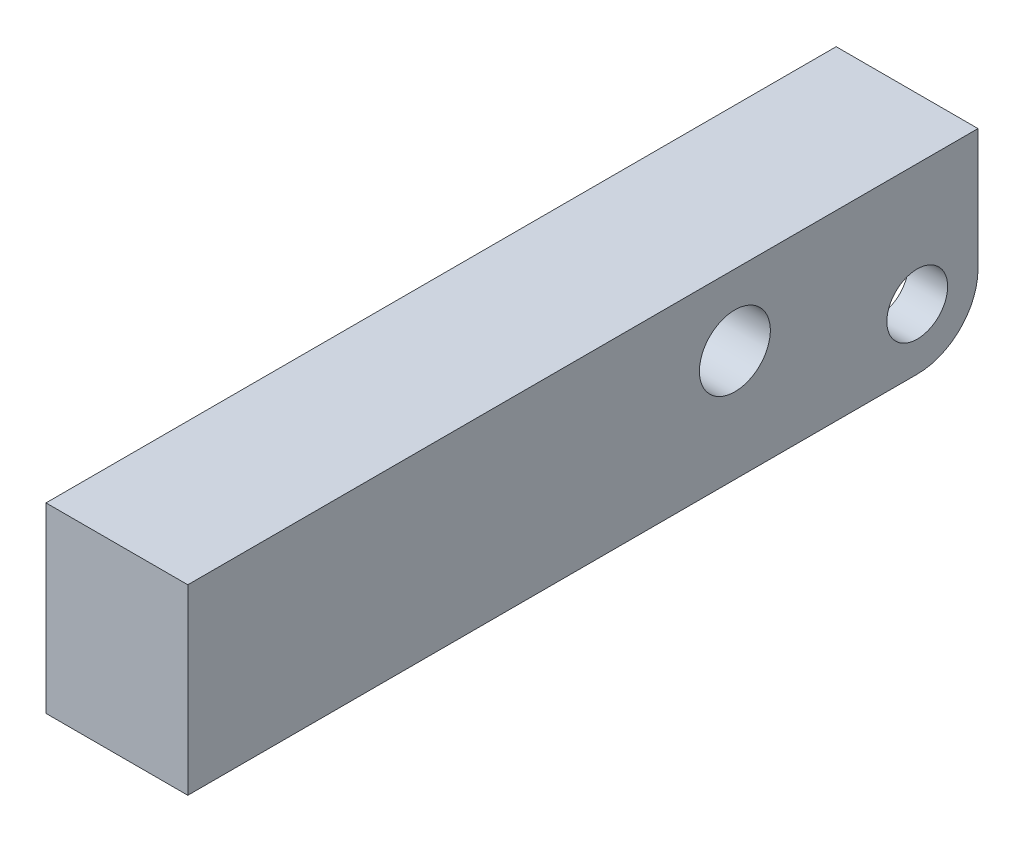
ISO-10303-21;
HEADER;
FILE_DESCRIPTION(('STEP AP214'),'2;1');
FILE_NAME('part.step','',(''),(''),'','','');
FILE_SCHEMA(('AUTOMOTIVE_DESIGN { 1 0 10303 214 1 1 1 1 }'));
ENDSEC;
DATA;
#1=APPLICATION_CONTEXT('core data for automotive mechanical design processes');
#2=APPLICATION_PROTOCOL_DEFINITION('international standard','automotive_design',2000,#1);
#3=PRODUCT_CONTEXT('',#1,'mechanical');
#4=PRODUCT('Part','Part','',(#3));
#5=PRODUCT_RELATED_PRODUCT_CATEGORY('part','',(#4));
#6=PRODUCT_DEFINITION_FORMATION('','',#4);
#7=PRODUCT_DEFINITION_CONTEXT('part definition',#1,'design');
#8=PRODUCT_DEFINITION('design','',#6,#7);
#9=PRODUCT_DEFINITION_SHAPE('','',#8);
#10=(LENGTH_UNIT() NAMED_UNIT(*) SI_UNIT(.MILLI.,.METRE.));
#11=(NAMED_UNIT(*) PLANE_ANGLE_UNIT() SI_UNIT($,.RADIAN.));
#12=(NAMED_UNIT(*) SI_UNIT($,.STERADIAN.) SOLID_ANGLE_UNIT());
#13=UNCERTAINTY_MEASURE_WITH_UNIT(LENGTH_MEASURE(1.E-05),#10,'distance_accuracy_value','');
#14=(GEOMETRIC_REPRESENTATION_CONTEXT(3) GLOBAL_UNCERTAINTY_ASSIGNED_CONTEXT((#13)) GLOBAL_UNIT_ASSIGNED_CONTEXT((#10,
#11,#12)) REPRESENTATION_CONTEXT('',''));
#15=CARTESIAN_POINT('',(0.,0.,0.));
#16=DIRECTION('',(0.,0.,1.));
#17=DIRECTION('',(1.,0.,0.));
#18=AXIS2_PLACEMENT_3D('',#15,#16,#17);
#19=CARTESIAN_POINT('',(-50.,5.99999999999999,6.));
#20=DIRECTION('',(1.,0.,0.));
#21=DIRECTION('',(0.,0.,-1.));
#22=AXIS2_PLACEMENT_3D('',#19,#20,#21);
#23=CYLINDRICAL_SURFACE('',#22,3.);
#24=CARTESIAN_POINT('',(-3.15,5.99999999999999,6.));
#25=DIRECTION('',(-1.,0.,0.));
#26=DIRECTION('',(0.,0.,1.));
#27=AXIS2_PLACEMENT_3D('',#24,#25,#26);
#28=CIRCLE('',#27,3.);
#29=CARTESIAN_POINT('',(-3.15,5.99999999999999,9.));
#30=VERTEX_POINT('',#29);
#31=EDGE_CURVE('E199',#30,#30,#28,.F.);
#32=ORIENTED_EDGE('',*,*,#31,.T.);
#33=EDGE_LOOP('',(#32));
#34=FACE_BOUND('',#33,.T.);
#35=CARTESIAN_POINT('',(-7.,5.99999999999999,6.));
#36=DIRECTION('',(-1.,0.,0.));
#37=DIRECTION('',(0.,0.,1.));
#38=AXIS2_PLACEMENT_3D('',#35,#36,#37);
#39=CIRCLE('',#38,3.);
#40=CARTESIAN_POINT('',(-7.,5.99999999999999,9.));
#41=VERTEX_POINT('',#40);
#42=EDGE_CURVE('E162',#41,#41,#39,.T.);
#43=ORIENTED_EDGE('',*,*,#42,.T.);
#44=EDGE_LOOP('',(#43));
#45=FACE_BOUND('',#44,.T.);
#46=ADVANCED_FACE('F33',(#34,#45),#23,.F.);
#47=CARTESIAN_POINT('',(-7.,18.,0.));
#48=DIRECTION('',(0.,0.,-1.));
#49=DIRECTION('',(0.,1.,0.));
#50=AXIS2_PLACEMENT_3D('',#47,#48,#49);
#51=PLANE('',#50);
#52=DIRECTION('',(0.,1.,0.));
#53=VECTOR('',#52,1.);
#54=CARTESIAN_POINT('',(7.,18.,0.));
#55=LINE('',#54,#53);
#56=CARTESIAN_POINT('',(7.,6.,0.));
#57=VERTEX_POINT('',#56);
#58=CARTESIAN_POINT('',(7.,18.,0.));
#59=VERTEX_POINT('',#58);
#60=EDGE_CURVE('E165',#57,#59,#55,.T.);
#61=ORIENTED_EDGE('',*,*,#60,.F.);
#62=DIRECTION('',(1.,0.,0.));
#63=VECTOR('',#62,1.);
#64=CARTESIAN_POINT('',(-7.,6.,0.));
#65=LINE('',#64,#63);
#66=CARTESIAN_POINT('',(3.15,6.,0.));
#67=VERTEX_POINT('',#66);
#68=EDGE_CURVE('E212',#57,#67,#65,.F.);
#69=ORIENTED_EDGE('',*,*,#68,.T.);
#70=DIRECTION('',(0.,-1.,0.));
#71=VECTOR('',#70,1.);
#72=CARTESIAN_POINT('',(3.15,13.2,0.));
#73=LINE('',#72,#71);
#74=CARTESIAN_POINT('',(3.15,13.2,0.));
#75=VERTEX_POINT('',#74);
#76=EDGE_CURVE('E132',#75,#67,#73,.T.);
#77=ORIENTED_EDGE('',*,*,#76,.F.);
#78=DIRECTION('',(1.,0.,0.));
#79=VECTOR('',#78,1.);
#80=CARTESIAN_POINT('',(-3.15,13.2,0.));
#81=LINE('',#80,#79);
#82=CARTESIAN_POINT('',(-3.15,13.2,0.));
#83=VERTEX_POINT('',#82);
#84=EDGE_CURVE('E139',#83,#75,#81,.T.);
#85=ORIENTED_EDGE('',*,*,#84,.F.);
#86=DIRECTION('',(0.,-1.,0.));
#87=VECTOR('',#86,1.);
#88=CARTESIAN_POINT('',(-3.15,13.2,0.));
#89=LINE('',#88,#87);
#90=CARTESIAN_POINT('',(-3.15,6.,0.));
#91=VERTEX_POINT('',#90);
#92=EDGE_CURVE('E122',#83,#91,#89,.T.);
#93=ORIENTED_EDGE('',*,*,#92,.T.);
#94=DIRECTION('',(1.,0.,0.));
#95=VECTOR('',#94,1.);
#96=CARTESIAN_POINT('',(-7.,6.,0.));
#97=LINE('',#96,#95);
#98=CARTESIAN_POINT('',(-7.,6.,0.));
#99=VERTEX_POINT('',#98);
#100=EDGE_CURVE('E210',#91,#99,#97,.F.);
#101=ORIENTED_EDGE('',*,*,#100,.T.);
#102=DIRECTION('',(0.,1.,0.));
#103=VECTOR('',#102,1.);
#104=CARTESIAN_POINT('',(-7.,18.,0.));
#105=LINE('',#104,#103);
#106=CARTESIAN_POINT('',(-7.,18.,0.));
#107=VERTEX_POINT('',#106);
#108=EDGE_CURVE('E176',#99,#107,#105,.T.);
#109=ORIENTED_EDGE('',*,*,#108,.T.);
#110=DIRECTION('',(1.,0.,0.));
#111=VECTOR('',#110,1.);
#112=CARTESIAN_POINT('',(-7.,18.,0.));
#113=LINE('',#112,#111);
#114=EDGE_CURVE('E187',#107,#59,#113,.T.);
#115=ORIENTED_EDGE('',*,*,#114,.T.);
#116=EDGE_LOOP('',(#61,#69,#77,#85,#93,#101,#109,#115));
#117=FACE_BOUND('',#116,.T.);
#118=ADVANCED_FACE('F144',(#117),#51,.T.);
#119=CARTESIAN_POINT('',(-7.,0.,0.));
#120=DIRECTION('',(0.,-1.,0.));
#121=DIRECTION('',(0.,0.,-1.));
#122=AXIS2_PLACEMENT_3D('',#119,#120,#121);
#123=PLANE('',#122);
#124=CARTESIAN_POINT('',(0.,0.,13.2));
#125=DIRECTION('',(0.,-1.,0.));
#126=DIRECTION('',(0.,0.,-1.));
#127=AXIS2_PLACEMENT_3D('',#124,#125,#126);
#128=CIRCLE('',#127,3.89999999999999);
#129=CARTESIAN_POINT('',(-3.89999999999999,0.,13.2));
#130=VERTEX_POINT('',#129);
#131=CARTESIAN_POINT('',(3.89999999999999,0.,13.2));
#132=VERTEX_POINT('',#131);
#133=EDGE_CURVE('E225',#130,#132,#128,.F.);
#134=ORIENTED_EDGE('',*,*,#133,.T.);
#135=DIRECTION('',(0.,0.,-1.));
#136=VECTOR('',#135,1.);
#137=CARTESIAN_POINT('',(3.89999999999999,0.,6.));
#138=LINE('',#137,#136);
#139=CARTESIAN_POINT('',(3.89999999999999,0.,6.));
#140=VERTEX_POINT('',#139);
#141=EDGE_CURVE('E227',#132,#140,#138,.T.);
#142=ORIENTED_EDGE('',*,*,#141,.T.);
#143=DIRECTION('',(1.,0.,0.));
#144=VECTOR('',#143,1.);
#145=CARTESIAN_POINT('',(-7.,0.,6.));
#146=LINE('',#145,#144);
#147=CARTESIAN_POINT('',(7.,0.,6.));
#148=VERTEX_POINT('',#147);
#149=EDGE_CURVE('E206',#140,#148,#146,.T.);
#150=ORIENTED_EDGE('',*,*,#149,.T.);
#151=DIRECTION('',(0.,0.,-1.));
#152=VECTOR('',#151,1.);
#153=CARTESIAN_POINT('',(7.,0.,0.));
#154=LINE('',#153,#152);
#155=CARTESIAN_POINT('',(7.,0.,78.));
#156=VERTEX_POINT('',#155);
#157=EDGE_CURVE('E173',#156,#148,#154,.T.);
#158=ORIENTED_EDGE('',*,*,#157,.F.);
#159=DIRECTION('',(1.,0.,0.));
#160=VECTOR('',#159,1.);
#161=CARTESIAN_POINT('',(-7.,0.,78.));
#162=LINE('',#161,#160);
#163=CARTESIAN_POINT('',(-7.,0.,78.));
#164=VERTEX_POINT('',#163);
#165=EDGE_CURVE('E188',#164,#156,#162,.T.);
#166=ORIENTED_EDGE('',*,*,#165,.F.);
#167=DIRECTION('',(0.,0.,-1.));
#168=VECTOR('',#167,1.);
#169=CARTESIAN_POINT('',(-7.,0.,0.));
#170=LINE('',#169,#168);
#171=CARTESIAN_POINT('',(-7.,0.,6.));
#172=VERTEX_POINT('',#171);
#173=EDGE_CURVE('E184',#164,#172,#170,.T.);
#174=ORIENTED_EDGE('',*,*,#173,.T.);
#175=DIRECTION('',(1.,0.,0.));
#176=VECTOR('',#175,1.);
#177=CARTESIAN_POINT('',(-7.,0.,6.));
#178=LINE('',#177,#176);
#179=CARTESIAN_POINT('',(-3.89999999999999,0.,6.));
#180=VERTEX_POINT('',#179);
#181=EDGE_CURVE('E190',#172,#180,#178,.T.);
#182=ORIENTED_EDGE('',*,*,#181,.T.);
#183=DIRECTION('',(0.,0.,1.));
#184=VECTOR('',#183,1.);
#185=CARTESIAN_POINT('',(-3.89999999999999,0.,13.2));
#186=LINE('',#185,#184);
#187=EDGE_CURVE('E223',#180,#130,#186,.T.);
#188=ORIENTED_EDGE('',*,*,#187,.T.);
#189=EDGE_LOOP('',(#134,#142,#150,#158,#166,#174,#182,#188));
#190=FACE_BOUND('',#189,.T.);
#191=ADVANCED_FACE('F250',(#190),#123,.T.);
#192=CARTESIAN_POINT('',(-7.,0.,78.));
#193=DIRECTION('',(0.,0.,1.));
#194=DIRECTION('',(1.,0.,0.));
#195=AXIS2_PLACEMENT_3D('',#192,#193,#194);
#196=PLANE('',#195);
#197=ORIENTED_EDGE('',*,*,#165,.T.);
#198=DIRECTION('',(0.,-1.,0.));
#199=VECTOR('',#198,1.);
#200=CARTESIAN_POINT('',(7.,0.,78.));
#201=LINE('',#200,#199);
#202=CARTESIAN_POINT('',(7.,18.,78.));
#203=VERTEX_POINT('',#202);
#204=EDGE_CURVE('E170',#203,#156,#201,.T.);
#205=ORIENTED_EDGE('',*,*,#204,.F.);
#206=DIRECTION('',(1.,0.,0.));
#207=VECTOR('',#206,1.);
#208=CARTESIAN_POINT('',(-7.,18.,78.));
#209=LINE('',#208,#207);
#210=CARTESIAN_POINT('',(-7.,18.,78.));
#211=VERTEX_POINT('',#210);
#212=EDGE_CURVE('E191',#211,#203,#209,.T.);
#213=ORIENTED_EDGE('',*,*,#212,.F.);
#214=DIRECTION('',(0.,-1.,0.));
#215=VECTOR('',#214,1.);
#216=CARTESIAN_POINT('',(-7.,0.,78.));
#217=LINE('',#216,#215);
#218=EDGE_CURVE('E181',#211,#164,#217,.T.);
#219=ORIENTED_EDGE('',*,*,#218,.T.);
#220=EDGE_LOOP('',(#197,#205,#213,#219));
#221=FACE_BOUND('',#220,.T.);
#222=ADVANCED_FACE('F266',(#221),#196,.T.);
#223=CARTESIAN_POINT('',(-7.,18.,78.));
#224=DIRECTION('',(0.,1.,0.));
#225=DIRECTION('',(0.,0.,1.));
#226=AXIS2_PLACEMENT_3D('',#223,#224,#225);
#227=PLANE('',#226);
#228=ORIENTED_EDGE('',*,*,#212,.T.);
#229=DIRECTION('',(0.,0.,1.));
#230=VECTOR('',#229,1.);
#231=CARTESIAN_POINT('',(7.,18.,78.));
#232=LINE('',#231,#230);
#233=EDGE_CURVE('E167',#59,#203,#232,.T.);
#234=ORIENTED_EDGE('',*,*,#233,.F.);
#235=ORIENTED_EDGE('',*,*,#114,.F.);
#236=DIRECTION('',(0.,0.,1.));
#237=VECTOR('',#236,1.);
#238=CARTESIAN_POINT('',(-7.,18.,78.));
#239=LINE('',#238,#237);
#240=EDGE_CURVE('E178',#107,#211,#239,.T.);
#241=ORIENTED_EDGE('',*,*,#240,.T.);
#242=EDGE_LOOP('',(#228,#234,#235,#241));
#243=FACE_BOUND('',#242,.T.);
#244=ADVANCED_FACE('F261',(#243),#227,.T.);
#245=CARTESIAN_POINT('',(-7.,0.,0.));
#246=DIRECTION('',(-1.,0.,0.));
#247=DIRECTION('',(0.,0.,1.));
#248=AXIS2_PLACEMENT_3D('',#245,#246,#247);
#249=PLANE('',#248);
#250=CARTESIAN_POINT('',(-7.,11.,24.));
#251=DIRECTION('',(-1.,0.,0.));
#252=DIRECTION('',(0.,0.,1.));
#253=AXIS2_PLACEMENT_3D('',#250,#251,#252);
#254=CIRCLE('',#253,3.5);
#255=CARTESIAN_POINT('',(-7.,11.,27.5));
#256=VERTEX_POINT('',#255);
#257=EDGE_CURVE('E157',#256,#256,#254,.T.);
#258=ORIENTED_EDGE('',*,*,#257,.F.);
#259=EDGE_LOOP('',(#258));
#260=FACE_BOUND('',#259,.T.);
#261=ORIENTED_EDGE('',*,*,#42,.F.);
#262=EDGE_LOOP('',(#261));
#263=FACE_BOUND('',#262,.T.);
#264=ORIENTED_EDGE('',*,*,#108,.F.);
#265=CARTESIAN_POINT('',(-7.,6.,6.));
#266=DIRECTION('',(-1.,0.,0.));
#267=DIRECTION('',(0.,0.,1.));
#268=AXIS2_PLACEMENT_3D('',#265,#266,#267);
#269=CIRCLE('',#268,6.);
#270=EDGE_CURVE('E218',#99,#172,#269,.T.);
#271=ORIENTED_EDGE('',*,*,#270,.T.);
#272=ORIENTED_EDGE('',*,*,#173,.F.);
#273=ORIENTED_EDGE('',*,*,#218,.F.);
#274=ORIENTED_EDGE('',*,*,#240,.F.);
#275=EDGE_LOOP('',(#264,#271,#272,#273,#274));
#276=FACE_BOUND('',#275,.T.);
#277=ADVANCED_FACE('F256',(#260,#263,#276),#249,.T.);
#278=CARTESIAN_POINT('',(7.,0.,0.));
#279=DIRECTION('',(-1.,0.,0.));
#280=DIRECTION('',(0.,0.,1.));
#281=AXIS2_PLACEMENT_3D('',#278,#279,#280);
#282=PLANE('',#281);
#283=CARTESIAN_POINT('',(7.,11.,24.));
#284=DIRECTION('',(-1.,0.,0.));
#285=DIRECTION('',(0.,0.,1.));
#286=AXIS2_PLACEMENT_3D('',#283,#284,#285);
#287=CIRCLE('',#286,3.5);
#288=CARTESIAN_POINT('',(7.,11.,27.5));
#289=VERTEX_POINT('',#288);
#290=EDGE_CURVE('E161',#289,#289,#287,.T.);
#291=ORIENTED_EDGE('',*,*,#290,.T.);
#292=EDGE_LOOP('',(#291));
#293=FACE_BOUND('',#292,.T.);
#294=CARTESIAN_POINT('',(7.,5.99999999999999,6.));
#295=DIRECTION('',(-1.,0.,0.));
#296=DIRECTION('',(0.,0.,1.));
#297=AXIS2_PLACEMENT_3D('',#294,#295,#296);
#298=CIRCLE('',#297,3.);
#299=CARTESIAN_POINT('',(7.,5.99999999999999,9.));
#300=VERTEX_POINT('',#299);
#301=EDGE_CURVE('E160',#300,#300,#298,.T.);
#302=ORIENTED_EDGE('',*,*,#301,.T.);
#303=EDGE_LOOP('',(#302));
#304=FACE_BOUND('',#303,.T.);
#305=ORIENTED_EDGE('',*,*,#157,.T.);
#306=CARTESIAN_POINT('',(7.,6.,6.));
#307=DIRECTION('',(-1.,0.,0.));
#308=DIRECTION('',(0.,0.,1.));
#309=AXIS2_PLACEMENT_3D('',#306,#307,#308);
#310=CIRCLE('',#309,6.);
#311=EDGE_CURVE('E208',#148,#57,#310,.F.);
#312=ORIENTED_EDGE('',*,*,#311,.T.);
#313=ORIENTED_EDGE('',*,*,#60,.T.);
#314=ORIENTED_EDGE('',*,*,#233,.T.);
#315=ORIENTED_EDGE('',*,*,#204,.T.);
#316=EDGE_LOOP('',(#305,#312,#313,#314,#315));
#317=FACE_BOUND('',#316,.T.);
#318=ADVANCED_FACE('F264',(#293,#304,#317),#282,.F.);
#319=CARTESIAN_POINT('',(3.15,5.99999999999999,6.));
#320=DIRECTION('',(1.,0.,0.));
#321=DIRECTION('',(0.,0.,-1.));
#322=AXIS2_PLACEMENT_3D('',#319,#320,#321);
#323=CIRCLE('',#322,3.);
#324=CARTESIAN_POINT('',(3.15,5.99999999999999,3.));
#325=VERTEX_POINT('',#324);
#326=EDGE_CURVE('E153',#325,#325,#323,.F.);
#327=ORIENTED_EDGE('',*,*,#326,.T.);
#328=EDGE_LOOP('',(#327));
#329=FACE_BOUND('',#328,.T.);
#330=ORIENTED_EDGE('',*,*,#301,.F.);
#331=EDGE_LOOP('',(#330));
#332=FACE_BOUND('',#331,.T.);
#333=ADVANCED_FACE('F278',(#329,#332),#23,.F.);
#334=CARTESIAN_POINT('',(-50.,11.,24.));
#335=DIRECTION('',(1.,0.,0.));
#336=DIRECTION('',(0.,0.,-1.));
#337=AXIS2_PLACEMENT_3D('',#334,#335,#336);
#338=CYLINDRICAL_SURFACE('',#337,3.5);
#339=ORIENTED_EDGE('',*,*,#257,.T.);
#340=EDGE_LOOP('',(#339));
#341=FACE_BOUND('',#340,.T.);
#342=ORIENTED_EDGE('',*,*,#290,.F.);
#343=EDGE_LOOP('',(#342));
#344=FACE_BOUND('',#343,.T.);
#345=ADVANCED_FACE('F287',(#341,#344),#338,.F.);
#346=CARTESIAN_POINT('',(-3.15,13.2,13.2));
#347=DIRECTION('',(-1.,0.,0.));
#348=DIRECTION('',(0.,0.,1.));
#349=AXIS2_PLACEMENT_3D('',#346,#347,#348);
#350=PLANE('',#349);
#351=DIRECTION('',(0.,-1.,0.));
#352=VECTOR('',#351,1.);
#353=CARTESIAN_POINT('',(-3.15,13.2,13.2));
#354=LINE('',#353,#352);
#355=CARTESIAN_POINT('',(-3.15,13.2,13.2));
#356=VERTEX_POINT('',#355);
#357=CARTESIAN_POINT('',(-3.15,0.749999999999999,13.2));
#358=VERTEX_POINT('',#357);
#359=EDGE_CURVE('E151',#356,#358,#354,.T.);
#360=ORIENTED_EDGE('',*,*,#359,.T.);
#361=DIRECTION('',(0.,0.,-1.));
#362=VECTOR('',#361,1.);
#363=CARTESIAN_POINT('',(-3.15,0.75,6.));
#364=LINE('',#363,#362);
#365=CARTESIAN_POINT('',(-3.15,0.750000000000001,3.09526249034443));
#366=VERTEX_POINT('',#365);
#367=EDGE_CURVE('E42',#358,#366,#364,.T.);
#368=ORIENTED_EDGE('',*,*,#367,.T.);
#369=CARTESIAN_POINT('',(-3.15,6.,6.));
#370=DIRECTION('',(-1.,0.,0.));
#371=DIRECTION('',(0.,0.,1.));
#372=AXIS2_PLACEMENT_3D('',#369,#370,#371);
#373=CIRCLE('',#372,6.);
#374=EDGE_CURVE('E128',#366,#91,#373,.F.);
#375=ORIENTED_EDGE('',*,*,#374,.T.);
#376=ORIENTED_EDGE('',*,*,#92,.F.);
#377=DIRECTION('',(0.,0.,-1.));
#378=VECTOR('',#377,1.);
#379=CARTESIAN_POINT('',(-3.15,13.2,13.2));
#380=LINE('',#379,#378);
#381=EDGE_CURVE('E126',#356,#83,#380,.T.);
#382=ORIENTED_EDGE('',*,*,#381,.F.);
#383=EDGE_LOOP('',(#360,#368,#375,#376,#382));
#384=FACE_BOUND('',#383,.T.);
#385=ORIENTED_EDGE('',*,*,#31,.F.);
#386=EDGE_LOOP('',(#385));
#387=FACE_BOUND('',#386,.T.);
#388=ADVANCED_FACE('F124',(#384,#387),#350,.F.);
#389=CARTESIAN_POINT('',(3.15,13.2,13.2));
#390=DIRECTION('',(1.,0.,0.));
#391=DIRECTION('',(0.,0.,-1.));
#392=AXIS2_PLACEMENT_3D('',#389,#390,#391);
#393=PLANE('',#392);
#394=CARTESIAN_POINT('',(3.15,6.,6.));
#395=DIRECTION('',(1.,0.,0.));
#396=DIRECTION('',(0.,0.,-1.));
#397=AXIS2_PLACEMENT_3D('',#394,#395,#396);
#398=CIRCLE('',#397,6.);
#399=CARTESIAN_POINT('',(3.15,0.750000000000001,3.09526249034444));
#400=VERTEX_POINT('',#399);
#401=EDGE_CURVE('E214',#67,#400,#398,.F.);
#402=ORIENTED_EDGE('',*,*,#401,.T.);
#403=DIRECTION('',(0.,0.,1.));
#404=VECTOR('',#403,1.);
#405=CARTESIAN_POINT('',(3.15,0.749999999999999,13.2));
#406=LINE('',#405,#404);
#407=CARTESIAN_POINT('',(3.15,0.749999999999999,13.2));
#408=VERTEX_POINT('',#407);
#409=EDGE_CURVE('E220',#400,#408,#406,.T.);
#410=ORIENTED_EDGE('',*,*,#409,.T.);
#411=DIRECTION('',(0.,-1.,0.));
#412=VECTOR('',#411,1.);
#413=CARTESIAN_POINT('',(3.15,13.2,13.2));
#414=LINE('',#413,#412);
#415=CARTESIAN_POINT('',(3.15,13.2,13.2));
#416=VERTEX_POINT('',#415);
#417=EDGE_CURVE('E154',#416,#408,#414,.T.);
#418=ORIENTED_EDGE('',*,*,#417,.F.);
#419=DIRECTION('',(0.,0.,1.));
#420=VECTOR('',#419,1.);
#421=CARTESIAN_POINT('',(3.15,13.2,13.2));
#422=LINE('',#421,#420);
#423=EDGE_CURVE('E146',#75,#416,#422,.T.);
#424=ORIENTED_EDGE('',*,*,#423,.F.);
#425=ORIENTED_EDGE('',*,*,#76,.T.);
#426=EDGE_LOOP('',(#402,#410,#418,#424,#425));
#427=FACE_BOUND('',#426,.T.);
#428=ORIENTED_EDGE('',*,*,#326,.F.);
#429=EDGE_LOOP('',(#428));
#430=FACE_BOUND('',#429,.T.);
#431=ADVANCED_FACE('F300',(#427,#430),#393,.F.);
#432=CARTESIAN_POINT('',(0.,13.2,13.2));
#433=DIRECTION('',(0.,-1.,0.));
#434=DIRECTION('',(0.,0.,-1.));
#435=AXIS2_PLACEMENT_3D('',#432,#433,#434);
#436=CYLINDRICAL_SURFACE('',#435,3.15);
#437=ORIENTED_EDGE('',*,*,#417,.T.);
#438=CARTESIAN_POINT('',(0.,0.749999999999999,13.2));
#439=DIRECTION('',(0.,-1.,0.));
#440=DIRECTION('',(0.,0.,-1.));
#441=AXIS2_PLACEMENT_3D('',#438,#439,#440);
#442=CIRCLE('',#441,3.15);
#443=EDGE_CURVE('E57',#408,#358,#442,.T.);
#444=ORIENTED_EDGE('',*,*,#443,.T.);
#445=ORIENTED_EDGE('',*,*,#359,.F.);
#446=CARTESIAN_POINT('',(0.,13.2,13.2));
#447=DIRECTION('',(0.,-1.,0.));
#448=DIRECTION('',(0.,0.,-1.));
#449=AXIS2_PLACEMENT_3D('',#446,#447,#448);
#450=CIRCLE('',#449,3.15);
#451=EDGE_CURVE('E133',#416,#356,#450,.T.);
#452=ORIENTED_EDGE('',*,*,#451,.F.);
#453=EDGE_LOOP('',(#437,#444,#445,#452));
#454=FACE_BOUND('',#453,.T.);
#455=ADVANCED_FACE('F302',(#454),#436,.F.);
#456=CARTESIAN_POINT('',(0.,13.2,13.2));
#457=DIRECTION('',(0.,-1.,0.));
#458=DIRECTION('',(0.,0.,-1.));
#459=AXIS2_PLACEMENT_3D('',#456,#457,#458);
#460=PLANE('',#459);
#461=ORIENTED_EDGE('',*,*,#381,.T.);
#462=ORIENTED_EDGE('',*,*,#84,.T.);
#463=ORIENTED_EDGE('',*,*,#423,.T.);
#464=ORIENTED_EDGE('',*,*,#451,.T.);
#465=EDGE_LOOP('',(#461,#462,#463,#464));
#466=FACE_BOUND('',#465,.T.);
#467=ADVANCED_FACE('F137',(#466),#460,.T.);
#468=CARTESIAN_POINT('',(-7.,6.,6.));
#469=DIRECTION('',(1.,0.,0.));
#470=DIRECTION('',(0.,0.,-1.));
#471=AXIS2_PLACEMENT_3D('',#468,#469,#470);
#472=CYLINDRICAL_SURFACE('',#471,6.);
#473=ORIENTED_EDGE('',*,*,#149,.F.);
#474=CARTESIAN_POINT('',(-2.09999999999995,6.,6.));
#475=DIRECTION('',(-0.707106781186551,-0.707106781186544,0.));
#476=DIRECTION('',(0.707106781186544,-0.707106781186551,0.));
#477=AXIS2_PLACEMENT_3D('',#474,#475,#476);
#478=ELLIPSE('',#477,8.48528137423853,6.);
#479=EDGE_CURVE('E229',#140,#400,#478,.F.);
#480=ORIENTED_EDGE('',*,*,#479,.T.);
#481=ORIENTED_EDGE('',*,*,#401,.F.);
#482=ORIENTED_EDGE('',*,*,#68,.F.);
#483=ORIENTED_EDGE('',*,*,#311,.F.);
#484=EDGE_LOOP('',(#473,#480,#481,#482,#483));
#485=FACE_BOUND('',#484,.T.);
#486=ADVANCED_FACE('F313',(#485),#472,.T.);
#487=CARTESIAN_POINT('',(-7.,6.,6.));
#488=DIRECTION('',(1.,0.,0.));
#489=DIRECTION('',(0.,0.,-1.));
#490=AXIS2_PLACEMENT_3D('',#487,#488,#489);
#491=CYLINDRICAL_SURFACE('',#490,6.);
#492=ORIENTED_EDGE('',*,*,#374,.F.);
#493=CARTESIAN_POINT('',(2.09999999999995,6.,6.));
#494=DIRECTION('',(0.707106781186551,-0.707106781186544,0.));
#495=DIRECTION('',(0.707106781186544,0.707106781186551,0.));
#496=AXIS2_PLACEMENT_3D('',#493,#494,#495);
#497=ELLIPSE('',#496,8.48528137423853,6.);
#498=EDGE_CURVE('E11',#366,#180,#497,.F.);
#499=ORIENTED_EDGE('',*,*,#498,.T.);
#500=ORIENTED_EDGE('',*,*,#181,.F.);
#501=ORIENTED_EDGE('',*,*,#270,.F.);
#502=ORIENTED_EDGE('',*,*,#100,.F.);
#503=EDGE_LOOP('',(#492,#499,#500,#501,#502));
#504=FACE_BOUND('',#503,.T.);
#505=ADVANCED_FACE('F247',(#504),#491,.T.);
#506=CARTESIAN_POINT('',(-3.15,0.749999999999999,13.2));
#507=DIRECTION('',(0.707106781186551,-0.707106781186544,0.));
#508=DIRECTION('',(0.707106781186544,0.707106781186551,0.));
#509=AXIS2_PLACEMENT_3D('',#506,#507,#508);
#510=PLANE('',#509);
#511=ORIENTED_EDGE('',*,*,#498,.F.);
#512=ORIENTED_EDGE('',*,*,#367,.F.);
#513=DIRECTION('',(0.707106781186544,0.707106781186551,0.));
#514=VECTOR('',#513,1.);
#515=CARTESIAN_POINT('',(-3.89999999999999,0.,13.2));
#516=LINE('',#515,#514);
#517=EDGE_CURVE('E37',#130,#358,#516,.T.);
#518=ORIENTED_EDGE('',*,*,#517,.F.);
#519=ORIENTED_EDGE('',*,*,#187,.F.);
#520=EDGE_LOOP('',(#511,#512,#518,#519));
#521=FACE_BOUND('',#520,.T.);
#522=ADVANCED_FACE('F35',(#521),#510,.T.);
#523=CARTESIAN_POINT('',(0.,0.749999999999999,13.2));
#524=DIRECTION('',(0.,-1.,0.));
#525=DIRECTION('',(0.,0.,-1.));
#526=AXIS2_PLACEMENT_3D('',#523,#524,#525);
#527=CONICAL_SURFACE('',#526,3.15,0.785398163397444);
#528=ORIENTED_EDGE('',*,*,#517,.T.);
#529=ORIENTED_EDGE('',*,*,#443,.F.);
#530=DIRECTION('',(-0.707106781186544,0.707106781186551,0.));
#531=VECTOR('',#530,1.);
#532=CARTESIAN_POINT('',(3.89999999999999,0.,13.2));
#533=LINE('',#532,#531);
#534=EDGE_CURVE('E232',#132,#408,#533,.T.);
#535=ORIENTED_EDGE('',*,*,#534,.F.);
#536=ORIENTED_EDGE('',*,*,#133,.F.);
#537=EDGE_LOOP('',(#528,#529,#535,#536));
#538=FACE_BOUND('',#537,.T.);
#539=ADVANCED_FACE('F241',(#538),#527,.F.);
#540=CARTESIAN_POINT('',(3.15,0.749999999999999,13.2));
#541=DIRECTION('',(-0.707106781186551,-0.707106781186544,0.));
#542=DIRECTION('',(0.707106781186544,-0.707106781186551,0.));
#543=AXIS2_PLACEMENT_3D('',#540,#541,#542);
#544=PLANE('',#543);
#545=ORIENTED_EDGE('',*,*,#479,.F.);
#546=ORIENTED_EDGE('',*,*,#141,.F.);
#547=ORIENTED_EDGE('',*,*,#534,.T.);
#548=ORIENTED_EDGE('',*,*,#409,.F.);
#549=EDGE_LOOP('',(#545,#546,#547,#548));
#550=FACE_BOUND('',#549,.T.);
#551=ADVANCED_FACE('F325',(#550),#544,.T.);
#552=CLOSED_SHELL('',(#46,#118,#191,#222,#244,#277,#318,#333,#345,#388,#431,#455,#467,#486,#505,
#522,#539,#551));
#553=MANIFOLD_SOLID_BREP('B2',#552);
#554=ADVANCED_BREP_SHAPE_REPRESENTATION('',(#18,#553),#14);
#555=SHAPE_DEFINITION_REPRESENTATION(#9,#554);
ENDSEC;
END-ISO-10303-21;
